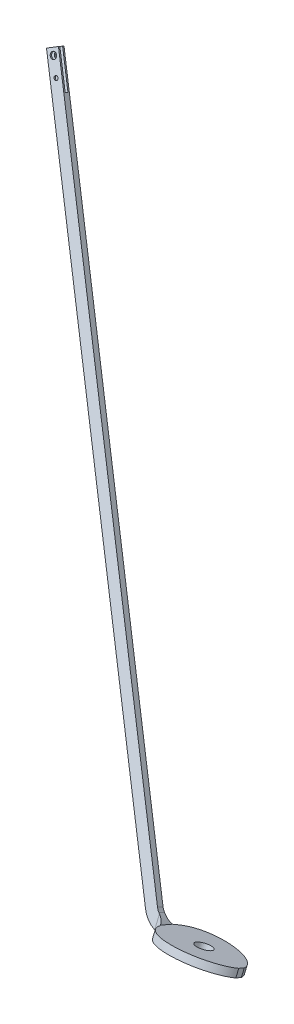
ISO-10303-21;
HEADER;
FILE_DESCRIPTION(('STEP AP214'),'2;1');
FILE_NAME('part.step','',(''),(''),'','','');
FILE_SCHEMA(('AUTOMOTIVE_DESIGN { 1 0 10303 214 1 1 1 1 }'));
ENDSEC;
DATA;
#1=APPLICATION_CONTEXT('core data for automotive mechanical design processes');
#2=APPLICATION_PROTOCOL_DEFINITION('international standard','automotive_design',2000,#1);
#3=PRODUCT_CONTEXT('',#1,'mechanical');
#4=PRODUCT('Part','Part','',(#3));
#5=PRODUCT_RELATED_PRODUCT_CATEGORY('part','',(#4));
#6=PRODUCT_DEFINITION_FORMATION('','',#4);
#7=PRODUCT_DEFINITION_CONTEXT('part definition',#1,'design');
#8=PRODUCT_DEFINITION('design','',#6,#7);
#9=PRODUCT_DEFINITION_SHAPE('','',#8);
#10=(LENGTH_UNIT() NAMED_UNIT(*) SI_UNIT(.MILLI.,.METRE.));
#11=(NAMED_UNIT(*) PLANE_ANGLE_UNIT() SI_UNIT($,.RADIAN.));
#12=(NAMED_UNIT(*) SI_UNIT($,.STERADIAN.) SOLID_ANGLE_UNIT());
#13=UNCERTAINTY_MEASURE_WITH_UNIT(LENGTH_MEASURE(1.E-05),#10,'distance_accuracy_value','');
#14=(GEOMETRIC_REPRESENTATION_CONTEXT(3) GLOBAL_UNCERTAINTY_ASSIGNED_CONTEXT((#13)) GLOBAL_UNIT_ASSIGNED_CONTEXT((#10,
#11,#12)) REPRESENTATION_CONTEXT('',''));
#15=CARTESIAN_POINT('',(0.,0.,0.));
#16=DIRECTION('',(0.,0.,1.));
#17=DIRECTION('',(1.,0.,0.));
#18=AXIS2_PLACEMENT_3D('',#15,#16,#17);
#19=CARTESIAN_POINT('',(73.8354743095712,-172.673766816012,339.410142549089));
#20=DIRECTION('',(0.49991000846134,-0.78962418854451,0.355785924827847));
#21=DIRECTION('',(0.84490869303847,0.534910553670447,0.));
#22=AXIS2_PLACEMENT_3D('',#19,#20,#21);
#23=PLANE('',#22);
#24=DIRECTION('',(-0.00948596016084249,0.405784850084445,0.913919401261277));
#25=VECTOR('',#24,1.);
#26=CARTESIAN_POINT('',(60.8450932528045,-179.577553216905,342.340626012758));
#27=LINE('',#26,#25);
#28=CARTESIAN_POINT('',(60.8830439239265,-181.200984807456,338.684290329165));
#29=VERTEX_POINT('',#28);
#30=CARTESIAN_POINT('',(60.8450932528045,-179.577553216905,342.340626012758));
#31=VERTEX_POINT('',#30);
#32=EDGE_CURVE('E269',#29,#31,#27,.T.);
#33=ORIENTED_EDGE('',*,*,#32,.T.);
#34=DIRECTION('',(-0.866025403784444,-0.460252426726214,0.195365564244626));
#35=VECTOR('',#34,1.);
#36=CARTESIAN_POINT('',(73.8354743095712,-172.673766816012,339.410142549089));
#37=LINE('',#36,#35);
#38=CARTESIAN_POINT('',(73.8354743095712,-172.673766816012,339.410142549089));
#39=VERTEX_POINT('',#38);
#40=EDGE_CURVE('E315',#39,#31,#37,.T.);
#41=ORIENTED_EDGE('',*,*,#40,.F.);
#42=DIRECTION('',(-0.00948596016084249,0.405784850084445,0.913919401261277));
#43=VECTOR('',#42,1.);
#44=CARTESIAN_POINT('',(73.8354743095712,-172.673766816012,339.410142549089));
#45=LINE('',#44,#43);
#46=CARTESIAN_POINT('',(73.8734249806931,-174.297198406563,335.753806865496));
#47=VERTEX_POINT('',#46);
#48=EDGE_CURVE('E270',#47,#39,#45,.T.);
#49=ORIENTED_EDGE('',*,*,#48,.F.);
#50=DIRECTION('',(-0.866025403784444,-0.460252426726214,0.195365564244626));
#51=VECTOR('',#50,1.);
#52=CARTESIAN_POINT('',(73.8734249806931,-174.297198406563,335.753806865496));
#53=LINE('',#52,#51);
#54=EDGE_CURVE('E287',#47,#29,#53,.T.);
#55=ORIENTED_EDGE('',*,*,#54,.T.);
#56=EDGE_LOOP('',(#33,#41,#49,#55));
#57=FACE_BOUND('',#56,.T.);
#58=ADVANCED_FACE('F42',(#57),#23,.F.);
#59=CARTESIAN_POINT('',(73.8354743095712,-172.673766816012,339.410142549089));
#60=DIRECTION('',(0.,0.390731128489272,0.920504853452441));
#61=DIRECTION('',(0.,-0.920504853452441,0.390731128489272));
#62=AXIS2_PLACEMENT_3D('',#59,#60,#61);
#63=PLANE('',#62);
#64=CARTESIAN_POINT('',(49.393037494552,-147.511267342591,328.729295209734));
#65=DIRECTION('',(0.,0.390731128489272,0.920504853452441));
#66=DIRECTION('',(0.,-0.920504853452441,0.390731128489272));
#67=AXIS2_PLACEMENT_3D('',#64,#65,#66);
#68=CIRCLE('',#67,4.00000000000001);
#69=CARTESIAN_POINT('',(49.393037494552,-151.1932867564,330.292219723691));
#70=VERTEX_POINT('',#69);
#71=EDGE_CURVE('E200',#70,#70,#68,.T.);
#72=ORIENTED_EDGE('',*,*,#71,.T.);
#73=EDGE_LOOP('',(#72));
#74=FACE_BOUND('',#73,.T.);
#75=CARTESIAN_POINT('',(60.1227202562195,-164.618256955643,335.990781481634));
#76=DIRECTION('',(0.,0.390731128489272,0.920504853452441));
#77=DIRECTION('',(0.,-0.920504853452441,0.390731128489272));
#78=AXIS2_PLACEMENT_3D('',#75,#76,#77);
#79=CIRCLE('',#78,2.49999999999999);
#80=CARTESIAN_POINT('',(60.1227202562195,-166.919519089275,336.967609302857));
#81=VERTEX_POINT('',#80);
#82=EDGE_CURVE('E396',#81,#81,#79,.T.);
#83=ORIENTED_EDGE('',*,*,#82,.T.);
#84=EDGE_LOOP('',(#83));
#85=FACE_BOUND('',#84,.T.);
#86=DIRECTION('',(-0.49999999999999,0.79718058739669,-0.338383083321077));
#87=VECTOR('',#86,1.);
#88=CARTESIAN_POINT('',(60.8450932528045,-179.577553216905,342.340626012758));
#89=LINE('',#88,#87);
#90=CARTESIAN_POINT('',(39.0377690065583,-144.808802112559,327.582166777903));
#91=VERTEX_POINT('',#90);
#92=EDGE_CURVE('E290',#31,#91,#89,.T.);
#93=ORIENTED_EDGE('',*,*,#92,.T.);
#94=DIRECTION('',(-0.866025403784444,-0.460252426726214,0.195365564244626));
#95=VECTOR('',#94,1.);
#96=CARTESIAN_POINT('',(52.028150063325,-137.905015711666,324.651683314234));
#97=LINE('',#96,#95);
#98=CARTESIAN_POINT('',(52.028150063325,-137.905015711666,324.651683314234));
#99=VERTEX_POINT('',#98);
#100=EDGE_CURVE('E312',#99,#91,#97,.T.);
#101=ORIENTED_EDGE('',*,*,#100,.F.);
#102=DIRECTION('',(-0.49999999999999,0.79718058739669,-0.338383083321077));
#103=VECTOR('',#102,1.);
#104=CARTESIAN_POINT('',(73.8354743095712,-172.673766816012,339.410142549089));
#105=LINE('',#104,#103);
#106=EDGE_CURVE('E273',#39,#99,#105,.T.);
#107=ORIENTED_EDGE('',*,*,#106,.F.);
#108=ORIENTED_EDGE('',*,*,#40,.T.);
#109=EDGE_LOOP('',(#93,#101,#107,#108));
#110=FACE_BOUND('',#109,.T.);
#111=ADVANCED_FACE('F469',(#74,#85,#110),#63,.F.);
#112=CARTESIAN_POINT('',(52.028150063325,-137.905015711666,324.651683314234));
#113=DIRECTION('',(0.49999999999999,-0.797180587396692,0.338383083321072));
#114=DIRECTION('',(0.847155616637362,0.53134486089523,0.));
#115=AXIS2_PLACEMENT_3D('',#112,#113,#114);
#116=PLANE('',#115);
#117=DIRECTION('',(0.,0.390731128489267,0.920504853452443));
#118=VECTOR('',#117,1.);
#119=CARTESIAN_POINT('',(39.0377690065583,-144.808802112559,327.582166777903));
#120=LINE('',#119,#118);
#121=CARTESIAN_POINT('',(39.0377690065583,-144.02733985558,329.423176484808));
#122=VERTEX_POINT('',#121);
#123=EDGE_CURVE('E292',#91,#122,#120,.T.);
#124=ORIENTED_EDGE('',*,*,#123,.T.);
#125=DIRECTION('',(-0.866025403784444,-0.460252426726214,0.195365564244626));
#126=VECTOR('',#125,1.);
#127=CARTESIAN_POINT('',(52.028150063325,-137.123553454687,326.492693021139));
#128=LINE('',#127,#126);
#129=CARTESIAN_POINT('',(52.028150063325,-137.123553454687,326.492693021139));
#130=VERTEX_POINT('',#129);
#131=EDGE_CURVE('E309',#130,#122,#128,.T.);
#132=ORIENTED_EDGE('',*,*,#131,.F.);
#133=DIRECTION('',(0.,0.390731128489267,0.920504853452443));
#134=VECTOR('',#133,1.);
#135=CARTESIAN_POINT('',(52.028150063325,-137.905015711666,324.651683314234));
#136=LINE('',#135,#134);
#137=EDGE_CURVE('E276',#99,#130,#136,.T.);
#138=ORIENTED_EDGE('',*,*,#137,.F.);
#139=ORIENTED_EDGE('',*,*,#100,.T.);
#140=EDGE_LOOP('',(#124,#132,#138,#139));
#141=FACE_BOUND('',#140,.T.);
#142=ADVANCED_FACE('F475',(#141),#116,.F.);
#143=CARTESIAN_POINT('',(52.028150063325,-137.123553454687,326.492693021139));
#144=DIRECTION('',(0.,-0.39073112848927,-0.920504853452442));
#145=DIRECTION('',(0.,0.920504853452442,-0.39073112848927));
#146=AXIS2_PLACEMENT_3D('',#143,#144,#145);
#147=PLANE('',#146);
#148=CARTESIAN_POINT('',(49.393037494552,-146.729805085612,330.570304916639));
#149=DIRECTION('',(0.,-0.39073112848927,-0.920504853452442));
#150=DIRECTION('',(0.,0.920504853452442,-0.39073112848927));
#151=AXIS2_PLACEMENT_3D('',#148,#149,#150);
#152=CIRCLE('',#151,4.00000000000001);
#153=CARTESIAN_POINT('',(49.393037494552,-143.047785671802,329.007380402682));
#154=VERTEX_POINT('',#153);
#155=EDGE_CURVE('E404',#154,#154,#152,.T.);
#156=ORIENTED_EDGE('',*,*,#155,.T.);
#157=EDGE_LOOP('',(#156));
#158=FACE_BOUND('',#157,.T.);
#159=CARTESIAN_POINT('',(60.1227202562195,-163.836794698665,337.831791188539));
#160=DIRECTION('',(0.,-0.39073112848927,-0.920504853452442));
#161=DIRECTION('',(0.,0.920504853452442,-0.39073112848927));
#162=AXIS2_PLACEMENT_3D('',#159,#160,#161);
#163=CIRCLE('',#162,2.49999999999999);
#164=CARTESIAN_POINT('',(60.1227202562195,-161.535532565034,336.854963367316));
#165=VERTEX_POINT('',#164);
#166=EDGE_CURVE('E391',#165,#165,#163,.T.);
#167=ORIENTED_EDGE('',*,*,#166,.T.);
#168=EDGE_LOOP('',(#167));
#169=FACE_BOUND('',#168,.T.);
#170=DIRECTION('',(0.,0.920504853452442,-0.39073112848927));
#171=VECTOR('',#170,1.);
#172=CARTESIAN_POINT('',(464.242672066385,-137.123553454669,326.492693021134));
#173=LINE('',#172,#171);
#174=CARTESIAN_POINT('',(464.242672066418,-806.651639318932,610.690504215532));
#175=VERTEX_POINT('',#174);
#176=CARTESIAN_POINT('',(464.242672066418,-791.64769856536,604.32170922174));
#177=VERTEX_POINT('',#176);
#178=EDGE_CURVE('E323',#175,#177,#173,.T.);
#179=ORIENTED_EDGE('',*,*,#178,.T.);
#180=CARTESIAN_POINT('',(368.692420540358,-898.085087793585,649.50170045222));
#181=DIRECTION('',(0.,-0.39073112848927,-0.920504853452442));
#182=DIRECTION('',(0.,0.920504853452442,-0.39073112848927));
#183=AXIS2_PLACEMENT_3D('',#180,#181,#182);
#184=CIRCLE('',#183,150.);
#185=CARTESIAN_POINT('',(463.207207415303,-790.867192931226,603.99040423614));
#186=VERTEX_POINT('',#185);
#187=EDGE_CURVE('E377',#177,#186,#184,.F.);
#188=ORIENTED_EDGE('',*,*,#187,.T.);
#189=CARTESIAN_POINT('',(472.658686102798,-780.14540344499,599.439274614532));
#190=DIRECTION('',(0.,-0.39073112848927,-0.920504853452442));
#191=DIRECTION('',(0.,0.920504853452442,-0.39073112848927));
#192=AXIS2_PLACEMENT_3D('',#189,#190,#191);
#193=CIRCLE('',#192,15.);
#194=CARTESIAN_POINT('',(459.668305046031,-787.049189845883,602.369758078202));
#195=VERTEX_POINT('',#194);
#196=EDGE_CURVE('E215',#186,#195,#193,.T.);
#197=ORIENTED_EDGE('',*,*,#196,.T.);
#198=DIRECTION('',(0.499999999999991,-0.79718058739669,0.338383083321074));
#199=VECTOR('',#198,1.);
#200=CARTESIAN_POINT('',(52.028150063325,-137.123553454687,326.492693021139));
#201=LINE('',#200,#199);
#202=EDGE_CURVE('E278',#130,#195,#201,.T.);
#203=ORIENTED_EDGE('',*,*,#202,.F.);
#204=ORIENTED_EDGE('',*,*,#131,.T.);
#205=DIRECTION('',(0.499999999999991,-0.79718058739669,0.338383083321074));
#206=VECTOR('',#205,1.);
#207=CARTESIAN_POINT('',(39.0377690065583,-144.02733985558,329.423176484808));
#208=LINE('',#207,#206);
#209=CARTESIAN_POINT('',(446.677923989264,-793.952976246776,605.300241541871));
#210=VERTEX_POINT('',#209);
#211=EDGE_CURVE('E294',#122,#210,#208,.T.);
#212=ORIENTED_EDGE('',*,*,#211,.T.);
#213=CARTESIAN_POINT('',(472.658686102798,-780.14540344499,599.439274614532));
#214=DIRECTION('',(0.,0.39073112848927,0.920504853452442));
#215=DIRECTION('',(0.,0.920504853452442,-0.39073112848927));
#216=AXIS2_PLACEMENT_3D('',#213,#214,#215);
#217=CIRCLE('',#216,30.);
#218=EDGE_CURVE('E216',#210,#175,#217,.T.);
#219=ORIENTED_EDGE('',*,*,#218,.T.);
#220=EDGE_LOOP('',(#179,#188,#197,#203,#204,#212,#219));
#221=FACE_BOUND('',#220,.T.);
#222=ADVANCED_FACE('F481',(#158,#169,#221),#147,.F.);
#223=CARTESIAN_POINT('',(52.028150063325,-140.249402482601,319.128654193519));
#224=DIRECTION('',(0.,0.39073112848927,0.920504853452442));
#225=DIRECTION('',(0.,-0.920504853452442,0.39073112848927));
#226=AXIS2_PLACEMENT_3D('',#223,#224,#225);
#227=PLANE('',#226);
#228=CARTESIAN_POINT('',(49.393037494552,-149.855654113526,323.206266089019));
#229=DIRECTION('',(0.,0.39073112848927,0.920504853452442));
#230=DIRECTION('',(0.,-0.920504853452442,0.39073112848927));
#231=AXIS2_PLACEMENT_3D('',#228,#229,#230);
#232=CIRCLE('',#231,4.00000000000001);
#233=CARTESIAN_POINT('',(49.393037494552,-153.537673527336,324.769190602977));
#234=VERTEX_POINT('',#233);
#235=EDGE_CURVE('E401',#234,#234,#232,.T.);
#236=ORIENTED_EDGE('',*,*,#235,.T.);
#237=EDGE_LOOP('',(#236));
#238=FACE_BOUND('',#237,.T.);
#239=CARTESIAN_POINT('',(60.1227202562195,-166.962643726579,330.46775236092));
#240=DIRECTION('',(0.,0.39073112848927,0.920504853452442));
#241=DIRECTION('',(0.,-0.920504853452442,0.39073112848927));
#242=AXIS2_PLACEMENT_3D('',#239,#240,#241);
#243=CIRCLE('',#242,2.49999999999999);
#244=CARTESIAN_POINT('',(60.1227202562195,-169.26390586021,331.444580182143));
#245=VERTEX_POINT('',#244);
#246=EDGE_CURVE('E387',#245,#245,#243,.T.);
#247=ORIENTED_EDGE('',*,*,#246,.T.);
#248=EDGE_LOOP('',(#247));
#249=FACE_BOUND('',#248,.T.);
#250=CARTESIAN_POINT('',(472.658686102798,-783.271252472904,592.075235786913));
#251=DIRECTION('',(0.,0.39073112848927,0.920504853452442));
#252=DIRECTION('',(0.,-0.920504853452442,0.39073112848927));
#253=AXIS2_PLACEMENT_3D('',#250,#251,#252);
#254=CIRCLE('',#253,15.);
#255=CARTESIAN_POINT('',(459.668305046031,-790.175038873797,595.005719250582));
#256=VERTEX_POINT('',#255);
#257=CARTESIAN_POINT('',(463.207207415303,-793.99304195914,596.626365408521));
#258=VERTEX_POINT('',#257);
#259=EDGE_CURVE('E253',#256,#258,#254,.T.);
#260=ORIENTED_EDGE('',*,*,#259,.T.);
#261=CARTESIAN_POINT('',(368.692420540358,-901.210936821499,642.1376616246));
#262=DIRECTION('',(0.,0.39073112848927,0.920504853452442));
#263=DIRECTION('',(0.,-0.920504853452442,0.39073112848927));
#264=AXIS2_PLACEMENT_3D('',#261,#262,#263);
#265=CIRCLE('',#264,150.);
#266=CARTESIAN_POINT('',(464.242672066418,-794.773547593274,596.95767039412));
#267=VERTEX_POINT('',#266);
#268=EDGE_CURVE('E53',#258,#267,#265,.F.);
#269=ORIENTED_EDGE('',*,*,#268,.T.);
#270=DIRECTION('',(0.,0.920504853452442,-0.39073112848927));
#271=VECTOR('',#270,1.);
#272=CARTESIAN_POINT('',(464.242672066385,-140.249402482583,319.128654193514));
#273=LINE('',#272,#271);
#274=CARTESIAN_POINT('',(464.242672066418,-809.777488346846,603.326465387913));
#275=VERTEX_POINT('',#274);
#276=EDGE_CURVE('E321',#267,#275,#273,.F.);
#277=ORIENTED_EDGE('',*,*,#276,.T.);
#278=CARTESIAN_POINT('',(472.658686102798,-783.271252472904,592.075235786913));
#279=DIRECTION('',(0.,0.39073112848927,0.920504853452442));
#280=DIRECTION('',(0.,-0.920504853452442,0.39073112848927));
#281=AXIS2_PLACEMENT_3D('',#278,#279,#280);
#282=CIRCLE('',#281,30.);
#283=CARTESIAN_POINT('',(446.677923989264,-797.07882527469,597.936202714252));
#284=VERTEX_POINT('',#283);
#285=EDGE_CURVE('E228',#275,#284,#282,.F.);
#286=ORIENTED_EDGE('',*,*,#285,.T.);
#287=DIRECTION('',(-0.499999999999991,0.79718058739669,-0.338383083321074));
#288=VECTOR('',#287,1.);
#289=CARTESIAN_POINT('',(39.0377690065583,-147.153188883495,322.059137657189));
#290=LINE('',#289,#288);
#291=CARTESIAN_POINT('',(39.0377690065583,-147.153188883495,322.059137657189));
#292=VERTEX_POINT('',#291);
#293=EDGE_CURVE('E296',#284,#292,#290,.T.);
#294=ORIENTED_EDGE('',*,*,#293,.T.);
#295=DIRECTION('',(-0.866025403784444,-0.460252426726214,0.195365564244626));
#296=VECTOR('',#295,1.);
#297=CARTESIAN_POINT('',(52.028150063325,-140.249402482601,319.128654193519));
#298=LINE('',#297,#296);
#299=CARTESIAN_POINT('',(52.028150063325,-140.249402482601,319.128654193519));
#300=VERTEX_POINT('',#299);
#301=EDGE_CURVE('E306',#300,#292,#298,.T.);
#302=ORIENTED_EDGE('',*,*,#301,.F.);
#303=DIRECTION('',(-0.499999999999991,0.79718058739669,-0.338383083321074));
#304=VECTOR('',#303,1.);
#305=CARTESIAN_POINT('',(52.028150063325,-140.249402482601,319.128654193519));
#306=LINE('',#305,#304);
#307=EDGE_CURVE('E281',#256,#300,#306,.T.);
#308=ORIENTED_EDGE('',*,*,#307,.F.);
#309=EDGE_LOOP('',(#260,#269,#277,#286,#294,#302,#308));
#310=FACE_BOUND('',#309,.T.);
#311=ADVANCED_FACE('F485',(#238,#249,#310),#227,.F.);
#312=CARTESIAN_POINT('',(52.028150063325,-139.467940225623,320.969663900424));
#313=DIRECTION('',(0.49999999999999,-0.797180587396683,0.338383083321093));
#314=DIRECTION('',(0.847155616637359,0.531344860895234,0.));
#315=AXIS2_PLACEMENT_3D('',#312,#313,#314);
#316=PLANE('',#315);
#317=DIRECTION('',(0.,0.390731128489291,0.920504853452433));
#318=VECTOR('',#317,1.);
#319=CARTESIAN_POINT('',(39.0377690065583,-146.371726626516,323.900147364094));
#320=LINE('',#319,#318);
#321=CARTESIAN_POINT('',(39.0377690065583,-146.371726626516,323.900147364094));
#322=VERTEX_POINT('',#321);
#323=EDGE_CURVE('E298',#292,#322,#320,.T.);
#324=ORIENTED_EDGE('',*,*,#323,.T.);
#325=DIRECTION('',(-0.866025403784444,-0.460252426726214,0.195365564244626));
#326=VECTOR('',#325,1.);
#327=CARTESIAN_POINT('',(52.028150063325,-139.467940225623,320.969663900424));
#328=LINE('',#327,#326);
#329=CARTESIAN_POINT('',(52.028150063325,-139.467940225623,320.969663900424));
#330=VERTEX_POINT('',#329);
#331=EDGE_CURVE('E303',#330,#322,#328,.T.);
#332=ORIENTED_EDGE('',*,*,#331,.F.);
#333=DIRECTION('',(0.,0.390731128489291,0.920504853452433));
#334=VECTOR('',#333,1.);
#335=CARTESIAN_POINT('',(52.028150063325,-139.467940225623,320.969663900424));
#336=LINE('',#335,#334);
#337=EDGE_CURVE('E283',#300,#330,#336,.T.);
#338=ORIENTED_EDGE('',*,*,#337,.F.);
#339=ORIENTED_EDGE('',*,*,#301,.T.);
#340=EDGE_LOOP('',(#324,#332,#338,#339));
#341=FACE_BOUND('',#340,.T.);
#342=ADVANCED_FACE('F495',(#341),#316,.F.);
#343=CARTESIAN_POINT('',(52.028150063325,-139.467940225623,320.969663900424));
#344=DIRECTION('',(0.,-0.390731128489271,-0.920504853452442));
#345=DIRECTION('',(0.,0.920504853452442,-0.390731128489271));
#346=AXIS2_PLACEMENT_3D('',#343,#344,#345);
#347=PLANE('',#346);
#348=CARTESIAN_POINT('',(49.393037494552,-149.074191856548,325.047275795924));
#349=DIRECTION('',(0.,-0.390731128489271,-0.920504853452442));
#350=DIRECTION('',(0.,0.920504853452442,-0.390731128489271));
#351=AXIS2_PLACEMENT_3D('',#348,#349,#350);
#352=CIRCLE('',#351,4.00000000000001);
#353=CARTESIAN_POINT('',(49.393037494552,-145.392172442738,323.484351281967));
#354=VERTEX_POINT('',#353);
#355=EDGE_CURVE('E47',#354,#354,#352,.T.);
#356=ORIENTED_EDGE('',*,*,#355,.T.);
#357=EDGE_LOOP('',(#356));
#358=FACE_BOUND('',#357,.T.);
#359=CARTESIAN_POINT('',(60.1227202562195,-166.181181469601,332.308762067824));
#360=DIRECTION('',(0.,-0.390731128489271,-0.920504853452442));
#361=DIRECTION('',(0.,0.920504853452442,-0.390731128489271));
#362=AXIS2_PLACEMENT_3D('',#359,#360,#361);
#363=CIRCLE('',#362,2.49999999999999);
#364=CARTESIAN_POINT('',(60.1227202562195,-163.879919335969,331.331934246601));
#365=VERTEX_POINT('',#364);
#366=EDGE_CURVE('E385',#365,#365,#363,.T.);
#367=ORIENTED_EDGE('',*,*,#366,.T.);
#368=EDGE_LOOP('',(#367));
#369=FACE_BOUND('',#368,.T.);
#370=DIRECTION('',(0.49999999999999,-0.797180587396691,0.338383083321076));
#371=VECTOR('',#370,1.);
#372=CARTESIAN_POINT('',(39.0377690065583,-146.371726626516,323.900147364094));
#373=LINE('',#372,#371);
#374=EDGE_CURVE('E274',#322,#29,#373,.T.);
#375=ORIENTED_EDGE('',*,*,#374,.T.);
#376=ORIENTED_EDGE('',*,*,#54,.F.);
#377=DIRECTION('',(0.49999999999999,-0.797180587396691,0.338383083321076));
#378=VECTOR('',#377,1.);
#379=CARTESIAN_POINT('',(52.028150063325,-139.467940225623,320.969663900424));
#380=LINE('',#379,#378);
#381=EDGE_CURVE('E285',#330,#47,#380,.T.);
#382=ORIENTED_EDGE('',*,*,#381,.F.);
#383=ORIENTED_EDGE('',*,*,#331,.T.);
#384=EDGE_LOOP('',(#375,#376,#382,#383));
#385=FACE_BOUND('',#384,.T.);
#386=ADVANCED_FACE('F499',(#358,#369,#385),#347,.F.);
#387=CARTESIAN_POINT('',(-70.8748069701137,-37.6666801680404,15.9885571415544));
#388=DIRECTION('',(-0.866025403784445,-0.460252426726213,0.195365564244627));
#389=DIRECTION('',(0.469295520911046,-0.88304117347541,0.));
#390=AXIS2_PLACEMENT_3D('',#387,#388,#389);
#391=PLANE('',#390);
#392=ORIENTED_EDGE('',*,*,#48,.T.);
#393=ORIENTED_EDGE('',*,*,#106,.T.);
#394=ORIENTED_EDGE('',*,*,#137,.T.);
#395=ORIENTED_EDGE('',*,*,#202,.T.);
#396=DIRECTION('',(0.,0.39073112848927,0.920504853452442));
#397=VECTOR('',#396,1.);
#398=CARTESIAN_POINT('',(459.668305046032,-845.4224437913,464.85098967006));
#399=LINE('',#398,#397);
#400=EDGE_CURVE('E225',#256,#195,#399,.T.);
#401=ORIENTED_EDGE('',*,*,#400,.F.);
#402=ORIENTED_EDGE('',*,*,#307,.T.);
#403=ORIENTED_EDGE('',*,*,#337,.T.);
#404=ORIENTED_EDGE('',*,*,#381,.T.);
#405=EDGE_LOOP('',(#392,#393,#394,#395,#401,#402,#403,#404));
#406=FACE_BOUND('',#405,.T.);
#407=ADVANCED_FACE('F503',(#406),#391,.F.);
#408=CARTESIAN_POINT('',(-83.8651880268803,-44.5704665689336,18.9190406052238));
#409=DIRECTION('',(-0.866025403784445,-0.460252426726213,0.195365564244627));
#410=DIRECTION('',(0.469295520911046,-0.88304117347541,0.));
#411=AXIS2_PLACEMENT_3D('',#408,#409,#410);
#412=PLANE('',#411);
#413=ORIENTED_EDGE('',*,*,#32,.F.);
#414=ORIENTED_EDGE('',*,*,#374,.F.);
#415=ORIENTED_EDGE('',*,*,#323,.F.);
#416=ORIENTED_EDGE('',*,*,#293,.F.);
#417=DIRECTION('',(0.,0.39073112848927,0.920504853452442));
#418=VECTOR('',#417,1.);
#419=CARTESIAN_POINT('',(446.677923989265,-852.326230192193,467.781473133729));
#420=LINE('',#419,#418);
#421=EDGE_CURVE('E218',#284,#210,#420,.T.);
#422=ORIENTED_EDGE('',*,*,#421,.T.);
#423=ORIENTED_EDGE('',*,*,#211,.F.);
#424=ORIENTED_EDGE('',*,*,#123,.F.);
#425=ORIENTED_EDGE('',*,*,#92,.F.);
#426=EDGE_LOOP('',(#413,#414,#415,#416,#422,#423,#424,#425));
#427=FACE_BOUND('',#426,.T.);
#428=ADVANCED_FACE('F460',(#427),#412,.T.);
#429=CARTESIAN_POINT('',(472.658686102799,-838.518657390406,461.92050620639));
#430=DIRECTION('',(0.,0.39073112848927,0.920504853452442));
#431=DIRECTION('',(0.,-0.920504853452442,0.39073112848927));
#432=AXIS2_PLACEMENT_3D('',#429,#430,#431);
#433=CYLINDRICAL_SURFACE('',#432,15.);
#434=ORIENTED_EDGE('',*,*,#196,.F.);
#435=DIRECTION('',(0.,0.39073112848927,0.920504853452442));
#436=VECTOR('',#435,1.);
#437=CARTESIAN_POINT('',(463.207207415304,-849.240446876642,466.471635827998));
#438=LINE('',#437,#436);
#439=EDGE_CURVE('E68',#186,#258,#438,.F.);
#440=ORIENTED_EDGE('',*,*,#439,.T.);
#441=ORIENTED_EDGE('',*,*,#259,.F.);
#442=ORIENTED_EDGE('',*,*,#400,.T.);
#443=EDGE_LOOP('',(#434,#440,#441,#442));
#444=FACE_BOUND('',#443,.T.);
#445=ADVANCED_FACE('F458',(#444),#433,.F.);
#446=CARTESIAN_POINT('',(572.658686102807,-866.133802993975,473.642440061067));
#447=DIRECTION('',(1.,0.,0.));
#448=DIRECTION('',(0.,0.,-1.));
#449=AXIS2_PLACEMENT_3D('',#446,#447,#448);
#450=PLANE('',#449);
#451=DIRECTION('',(0.,-0.390731128489271,-0.920504853452442));
#452=VECTOR('',#451,1.);
#453=CARTESIAN_POINT('',(572.658686102806,-798.555500514034,607.253897184317));
#454=LINE('',#453,#452);
#455=CARTESIAN_POINT('',(572.658686102806,-798.555500514034,607.253897184317));
#456=VERTEX_POINT('',#455);
#457=CARTESIAN_POINT('',(572.658686102806,-801.681349541948,599.889858356697));
#458=VERTEX_POINT('',#457);
#459=EDGE_CURVE('E192',#456,#458,#454,.T.);
#460=ORIENTED_EDGE('',*,*,#459,.F.);
#461=DIRECTION('',(0.,0.920504853452442,-0.390731128489269));
#462=VECTOR('',#461,1.);
#463=CARTESIAN_POINT('',(572.658686102806,-807.760549048559,611.161208469209));
#464=LINE('',#463,#462);
#465=CARTESIAN_POINT('',(572.658686102806,-807.760549048559,611.161208469209));
#466=VERTEX_POINT('',#465);
#467=EDGE_CURVE('E207',#466,#456,#464,.T.);
#468=ORIENTED_EDGE('',*,*,#467,.F.);
#469=DIRECTION('',(0.,0.39073112848927,0.920504853452442));
#470=VECTOR('',#469,1.);
#471=CARTESIAN_POINT('',(572.658686102807,-866.133802993975,473.642440061067));
#472=LINE('',#471,#470);
#473=CARTESIAN_POINT('',(572.658686102806,-810.886398076473,603.79716964159));
#474=VERTEX_POINT('',#473);
#475=EDGE_CURVE('E229',#474,#466,#472,.T.);
#476=ORIENTED_EDGE('',*,*,#475,.F.);
#477=DIRECTION('',(0.,-0.920504853452442,0.39073112848927));
#478=VECTOR('',#477,1.);
#479=CARTESIAN_POINT('',(572.658686102806,-810.886398076473,603.79716964159));
#480=LINE('',#479,#478);
#481=EDGE_CURVE('E208',#458,#474,#480,.T.);
#482=ORIENTED_EDGE('',*,*,#481,.F.);
#483=EDGE_LOOP('',(#460,#468,#476,#482));
#484=FACE_BOUND('',#483,.T.);
#485=ADVANCED_FACE('F205',(#484),#450,.T.);
#486=CARTESIAN_POINT('',(472.658686102799,-866.133802993979,473.642440061068));
#487=DIRECTION('',(0.,-0.920504853452442,0.39073112848927));
#488=DIRECTION('',(0.,-0.39073112848927,-0.920504853452442));
#489=AXIS2_PLACEMENT_3D('',#486,#487,#488);
#490=PLANE('',#489);
#491=CARTESIAN_POINT('',(522.658686102802,-809.323473562518,607.4791890554));
#492=DIRECTION('',(0.,-0.920504853452442,0.39073112848927));
#493=DIRECTION('',(0.,-0.39073112848927,-0.920504853452442));
#494=AXIS2_PLACEMENT_3D('',#491,#492,#493);
#495=CIRCLE('',#494,10.);
#496=CARTESIAN_POINT('',(522.658686102802,-813.230784847411,598.274140520876));
#497=VERTEX_POINT('',#496);
#498=EDGE_CURVE('E363',#497,#497,#495,.T.);
#499=ORIENTED_EDGE('',*,*,#498,.F.);
#500=EDGE_LOOP('',(#499));
#501=FACE_BOUND('',#500,.T.);
#502=DIRECTION('',(0.,0.39073112848927,0.920504853452442));
#503=VECTOR('',#502,1.);
#504=CARTESIAN_POINT('',(472.658686102799,-866.133802993979,473.642440061068));
#505=LINE('',#504,#503);
#506=CARTESIAN_POINT('',(472.658686102798,-812.683373909832,599.563759873253));
#507=VERTEX_POINT('',#506);
#508=CARTESIAN_POINT('',(472.658686102798,-805.963573215208,615.394618237548));
#509=VERTEX_POINT('',#508);
#510=EDGE_CURVE('E231',#507,#509,#505,.T.);
#511=ORIENTED_EDGE('',*,*,#510,.F.);
#512=CARTESIAN_POINT('',(464.242672066418,-814.79370936137,594.592121107066));
#513=DIRECTION('',(0.,-0.920504853452442,0.39073112848927));
#514=DIRECTION('',(0.,-0.39073112848927,-0.920504853452442));
#515=AXIS2_PLACEMENT_3D('',#512,#513,#514);
#516=CIRCLE('',#515,10.);
#517=CARTESIAN_POINT('',(473.913286852462,-813.79913094925,596.935201012255));
#518=VERTEX_POINT('',#517);
#519=EDGE_CURVE('E337',#507,#518,#516,.F.);
#520=ORIENTED_EDGE('',*,*,#519,.T.);
#521=CARTESIAN_POINT('',(572.658686102806,-810.886398076473,603.79716964159));
#522=CARTESIAN_POINT('',(559.130606949825,-826.198653377937,567.723756763539));
#523=CARTESIAN_POINT('',(476.930397752689,-831.068210059177,556.251800135536));
#524=CARTESIAN_POINT('',(472.658686102798,-810.886398076477,603.797169641591));
#525=B_SPLINE_CURVE_WITH_KNOTS('',3,(#521,#522,#523,#524),.UNSPECIFIED.,.F.,.F.,(4,4),(0.,1.),.UNSPECIFIED.);
#526=EDGE_CURVE('E221',#474,#518,#525,.T.);
#527=ORIENTED_EDGE('',*,*,#526,.F.);
#528=ORIENTED_EDGE('',*,*,#475,.T.);
#529=CARTESIAN_POINT('',(472.658686102798,-807.760549048563,611.16120846921));
#530=CARTESIAN_POINT('',(476.930397752689,-787.578737065863,658.706577975265));
#531=CARTESIAN_POINT('',(559.130606949824,-792.448293747096,647.23462134726));
#532=CARTESIAN_POINT('',(572.658686102806,-807.760549048558,611.161208469209));
#533=B_SPLINE_CURVE_WITH_KNOTS('',3,(#529,#530,#531,#532),.UNSPECIFIED.,.F.,.F.,(4,4),(0.,1.),.UNSPECIFIED.);
#534=CARTESIAN_POINT('',(473.913286852462,-804.847816175789,618.023177098547));
#535=VERTEX_POINT('',#534);
#536=EDGE_CURVE('E213',#535,#466,#533,.T.);
#537=ORIENTED_EDGE('',*,*,#536,.F.);
#538=CARTESIAN_POINT('',(464.242672066418,-803.853237763671,620.366257003735));
#539=DIRECTION('',(0.,-0.920504853452442,0.39073112848927));
#540=DIRECTION('',(0.,-0.39073112848927,-0.920504853452442));
#541=AXIS2_PLACEMENT_3D('',#538,#539,#540);
#542=CIRCLE('',#541,10.);
#543=EDGE_CURVE('E362',#535,#509,#542,.F.);
#544=ORIENTED_EDGE('',*,*,#543,.T.);
#545=EDGE_LOOP('',(#511,#520,#527,#528,#537,#544));
#546=FACE_BOUND('',#545,.T.);
#547=ADVANCED_FACE('F348',(#501,#546),#490,.T.);
#548=CARTESIAN_POINT('',(472.658686102799,-838.518657390406,461.92050620639));
#549=DIRECTION('',(0.,0.39073112848927,0.920504853452442));
#550=DIRECTION('',(0.,-0.920504853452442,0.39073112848927));
#551=AXIS2_PLACEMENT_3D('',#548,#549,#550);
#552=CYLINDRICAL_SURFACE('',#551,30.);
#553=ORIENTED_EDGE('',*,*,#285,.F.);
#554=CARTESIAN_POINT('',(464.242672066418,-809.777488346846,603.326465387913));
#555=CARTESIAN_POINT('',(464.507090761484,-809.848646645193,603.356707272462));
#556=CARTESIAN_POINT('',(464.772624213005,-809.920524129679,603.375787743976));
#557=CARTESIAN_POINT('',(465.3040513973,-810.065558891543,603.391251877887));
#558=CARTESIAN_POINT('',(465.569945188594,-810.138716407809,603.38763125764));
#559=CARTESIAN_POINT('',(466.099541329562,-810.285964058909,603.357340776114));
#560=CARTESIAN_POINT('',(466.363247206058,-810.360051796996,603.330721473399));
#561=CARTESIAN_POINT('',(466.886998653535,-810.509237804016,603.254468509452));
#562=CARTESIAN_POINT('',(467.147044561318,-810.584335978705,603.204836980337));
#563=CARTESIAN_POINT('',(467.662000050522,-810.735716521845,603.082664932373));
#564=CARTESIAN_POINT('',(467.916897174468,-810.81200111828,603.010074619349));
#565=CARTESIAN_POINT('',(468.418910539616,-810.96567636121,602.842556889574));
#566=CARTESIAN_POINT('',(468.666026495301,-811.04306704814,602.747628654249));
#567=CARTESIAN_POINT('',(469.150512473009,-811.199116518699,602.536237232369));
#568=CARTESIAN_POINT('',(469.38788065741,-811.277775537575,602.419770007913));
#569=CARTESIAN_POINT('',(469.850928649711,-811.436556907339,602.166386652315));
#570=CARTESIAN_POINT('',(470.076608030637,-811.516679311538,602.029469774885));
#571=CARTESIAN_POINT('',(470.527185068852,-811.683326036321,601.727993853085));
#572=CARTESIAN_POINT('',(470.751282557463,-811.769952602205,601.562294057915));
#573=CARTESIAN_POINT('',(471.182540367295,-811.945457202511,601.211173511737));
#574=CARTESIAN_POINT('',(471.389698593964,-812.034335513589,601.02575032842));
#575=CARTESIAN_POINT('',(471.785799773293,-812.214875376866,600.636647534265));
#576=CARTESIAN_POINT('',(471.974699443008,-812.30654289649,600.432926649548));
#577=CARTESIAN_POINT('',(472.332242833428,-812.492738702423,600.009683448481));
#578=CARTESIAN_POINT('',(472.50088922074,-812.587266610067,599.79016321842));
#579=CARTESIAN_POINT('',(472.658686102798,-812.683373909832,599.563759873253));
#580=B_SPLINE_CURVE_WITH_KNOTS('',3,(#554,#555,#556,#557,#558,#559,#560,#561,#562,#563,#564,
#565,#566,#567,#568,#569,#570,#571,#572,#573,#574,#575,#576,#577,#578,#579),.UNSPECIFIED.,.F.,
.F.,(4,2,2,2,2,2,2,2,2,2,2,2,4),(0.,0.82629257994111,1.65274104774769,2.4773773231857,
3.30193721015237,4.12829785145712,4.95468877950283,5.78123478789828,6.60781096753262,
7.48219481252137,8.35668661275058,9.23320306123304,10.1096039781869),.UNSPECIFIED.);
#581=EDGE_CURVE('E328',#275,#507,#580,.T.);
#582=ORIENTED_EDGE('',*,*,#581,.T.);
#583=ORIENTED_EDGE('',*,*,#510,.T.);
#584=CARTESIAN_POINT('',(472.658686102798,-805.963573215208,615.394618237548));
#585=CARTESIAN_POINT('',(472.509770037335,-806.054259716234,615.180964356748));
#586=CARTESIAN_POINT('',(472.351199390334,-806.14151492514,614.972577106037));
#587=CARTESIAN_POINT('',(472.015962009804,-806.30775440617,614.56735704601));
#588=CARTESIAN_POINT('',(471.83929409425,-806.386738137359,614.370524992746));
#589=CARTESIAN_POINT('',(471.469420269461,-806.534883821916,613.989799479711));
#590=CARTESIAN_POINT('',(471.276243963893,-806.604062788894,613.805883893725));
#591=CARTESIAN_POINT('',(470.87451300179,-806.731405292151,613.45154468522));
#592=CARTESIAN_POINT('',(470.665959108198,-806.789569374413,613.28112039421));
#593=CARTESIAN_POINT('',(470.23464978274,-806.89371018241,612.954307215148));
#594=CARTESIAN_POINT('',(470.011870056798,-806.939665328479,612.797943497966));
#595=CARTESIAN_POINT('',(469.554165902452,-807.018112139741,612.500328509892));
#596=CARTESIAN_POINT('',(469.319241217478,-807.050603520371,612.359077558461));
#597=CARTESIAN_POINT('',(468.839122343987,-807.101153661547,612.092319785507));
#598=CARTESIAN_POINT('',(468.593928188534,-807.119212468557,611.966812913298));
#599=CARTESIAN_POINT('',(468.09525475935,-807.140146310183,611.732038737265));
#600=CARTESIAN_POINT('',(467.841775295977,-807.143020997006,611.622771805474));
#601=CARTESIAN_POINT('',(467.31445038112,-807.132801807375,611.415269975977));
#602=CARTESIAN_POINT('',(467.040252020867,-807.118820001415,611.317973735559));
#603=CARTESIAN_POINT('',(466.48733436254,-807.073110478146,611.142076567553));
#604=CARTESIAN_POINT('',(466.208614314556,-807.041379787396,611.063478775629));
#605=CARTESIAN_POINT('',(465.64833822145,-806.960102077838,610.92486123695));
#606=CARTESIAN_POINT('',(465.366776452322,-806.910505857132,610.864893655918));
#607=CARTESIAN_POINT('',(464.803948256154,-806.793968185093,610.763694944033));
#608=CARTESIAN_POINT('',(464.522681771382,-806.727031244182,610.722458948655));
#609=CARTESIAN_POINT('',(464.242672066418,-806.651639318932,610.690504215532));
#610=B_SPLINE_CURVE_WITH_KNOTS('',3,(#584,#585,#586,#587,#588,#589,#590,#591,#592,#593,#594,
#595,#596,#597,#598,#599,#600,#601,#602,#603,#604,#605,#606,#607,#608,#609),.UNSPECIFIED.,.F.,
.F.,(4,2,2,2,2,2,2,2,2,2,2,2,4),(0.,0.827074606174495,1.65420326733005,2.479878613723,
3.3055130225028,4.132597199772,4.95969885689159,5.78679785122383,6.61391579019176,
7.48657410652534,8.35937866160806,9.23460554291118,10.1096050008468),.UNSPECIFIED.);
#611=EDGE_CURVE('E355',#509,#175,#610,.T.);
#612=ORIENTED_EDGE('',*,*,#611,.T.);
#613=ORIENTED_EDGE('',*,*,#218,.F.);
#614=ORIENTED_EDGE('',*,*,#421,.F.);
#615=EDGE_LOOP('',(#553,#582,#583,#612,#613,#614));
#616=FACE_BOUND('',#615,.T.);
#617=ADVANCED_FACE('F342',(#616),#552,.T.);
#618=CARTESIAN_POINT('',(572.658686102812,-928.336078845421,653.651601299865));
#619=CARTESIAN_POINT('',(559.130606949831,-943.648334146886,617.578188421814));
#620=CARTESIAN_POINT('',(476.930397752694,-948.517890828126,606.106231793812));
#621=CARTESIAN_POINT('',(472.658686102804,-928.336078845426,653.651601299866));
#622=B_SPLINE_CURVE_WITH_KNOTS('',3,(#618,#619,#620,#621),.UNSPECIFIED.,.F.,.F.,(4,4),(0.,1.),.UNSPECIFIED.);
#623=DIRECTION('',(0.,0.920504853452442,-0.39073112848927));
#624=VECTOR('',#623,1.);
#625=SURFACE_OF_LINEAR_EXTRUSION('',#622,#624);
#626=CARTESIAN_POINT('',(572.658686102806,-801.681349541948,599.889858356697));
#627=CARTESIAN_POINT('',(559.825252030608,-816.207345190391,565.668757142368));
#628=CARTESIAN_POINT('',(485.191029648613,-821.33553992023,553.587487455681));
#629=CARTESIAN_POINT('',(473.913286852462,-804.594082414726,593.027889727362));
#630=B_SPLINE_CURVE_WITH_KNOTS('',3,(#626,#627,#628,#629),.UNSPECIFIED.,.F.,.F.,(4,4),(0.,
0.948651610259786),.UNSPECIFIED.);
#631=CARTESIAN_POINT('',(473.913286852462,-804.594082414726,593.027889727362));
#632=VERTEX_POINT('',#631);
#633=EDGE_CURVE('E209',#458,#632,#630,.T.);
#634=ORIENTED_EDGE('',*,*,#633,.F.);
#635=ORIENTED_EDGE('',*,*,#481,.T.);
#636=ORIENTED_EDGE('',*,*,#526,.T.);
#637=DIRECTION('',(0.,0.920504853452442,-0.39073112848927));
#638=VECTOR('',#637,1.);
#639=CARTESIAN_POINT('',(473.913286852462,-813.799130949251,596.935201012254));
#640=LINE('',#639,#638);
#641=EDGE_CURVE('E318',#518,#632,#640,.T.);
#642=ORIENTED_EDGE('',*,*,#641,.T.);
#643=EDGE_LOOP('',(#634,#635,#636,#642));
#644=FACE_BOUND('',#643,.T.);
#645=ADVANCED_FACE('F347',(#644),#625,.T.);
#646=CARTESIAN_POINT('',(472.658686102804,-925.210229817512,661.015640127486));
#647=CARTESIAN_POINT('',(476.930397752694,-905.028417834811,708.561009633541));
#648=CARTESIAN_POINT('',(559.13060694983,-909.897974516044,697.089053005535));
#649=CARTESIAN_POINT('',(572.658686102812,-925.210229817507,661.015640127485));
#650=B_SPLINE_CURVE_WITH_KNOTS('',3,(#646,#647,#648,#649),.UNSPECIFIED.,.F.,.F.,(4,4),(0.,1.),.UNSPECIFIED.);
#651=DIRECTION('',(0.,0.920504853452442,-0.39073112848927));
#652=VECTOR('',#651,1.);
#653=SURFACE_OF_LINEAR_EXTRUSION('',#650,#652);
#654=CARTESIAN_POINT('',(473.913286852461,-795.642767641266,614.115865813652));
#655=CARTESIAN_POINT('',(485.191029648611,-778.90131013576,653.556268085334));
#656=CARTESIAN_POINT('',(559.825252030607,-784.029504865592,641.474998398646));
#657=CARTESIAN_POINT('',(572.658686102806,-798.555500514034,607.253897184317));
#658=B_SPLINE_CURVE_WITH_KNOTS('',3,(#654,#655,#656,#657),.UNSPECIFIED.,.F.,.F.,(4,4),
(0.051348389740203,1.),.UNSPECIFIED.);
#659=CARTESIAN_POINT('',(473.913286852462,-795.642767641265,614.115865813653));
#660=VERTEX_POINT('',#659);
#661=EDGE_CURVE('E188',#660,#456,#658,.T.);
#662=ORIENTED_EDGE('',*,*,#661,.F.);
#663=DIRECTION('',(0.,0.920504853452442,-0.39073112848927));
#664=VECTOR('',#663,1.);
#665=CARTESIAN_POINT('',(473.913286852462,-791.040243374002,612.162210171208));
#666=LINE('',#665,#664);
#667=EDGE_CURVE('E326',#660,#535,#666,.F.);
#668=ORIENTED_EDGE('',*,*,#667,.T.);
#669=ORIENTED_EDGE('',*,*,#536,.T.);
#670=ORIENTED_EDGE('',*,*,#467,.T.);
#671=EDGE_LOOP('',(#662,#668,#669,#670));
#672=FACE_BOUND('',#671,.T.);
#673=ADVANCED_FACE('F211',(#672),#653,.T.);
#674=CARTESIAN_POINT('',(464.242672066418,-807.889922960477,591.661637643397));
#675=DIRECTION('',(0.,0.920504853452442,-0.39073112848927));
#676=DIRECTION('',(0.,0.39073112848927,0.920504853452442));
#677=AXIS2_PLACEMENT_3D('',#674,#675,#676);
#678=CYLINDRICAL_SURFACE('',#677,10.);
#679=ORIENTED_EDGE('',*,*,#276,.F.);
#680=CARTESIAN_POINT('',(464.242672066418,-794.773547593274,596.95767039412));
#681=CARTESIAN_POINT('',(464.566490923886,-795.019861849532,597.062183840641));
#682=CARTESIAN_POINT('',(464.889147583035,-795.27354726256,597.152819906231));
#683=CARTESIAN_POINT('',(465.530468492161,-795.794119914058,597.306113738044));
#684=CARTESIAN_POINT('',(465.849132506517,-796.061007927108,597.368769860553));
#685=CARTESIAN_POINT('',(466.485120861828,-796.610180120124,597.466538059045));
#686=CARTESIAN_POINT('',(466.802365998597,-796.892625965057,597.501258007393));
#687=CARTESIAN_POINT('',(467.429266094822,-797.467865559354,597.541149516156));
#688=CARTESIAN_POINT('',(467.738920729339,-797.760659750412,597.546319813783));
#689=CARTESIAN_POINT('',(468.386840584404,-798.391971160516,597.525025938147));
#690=CARTESIAN_POINT('',(468.723864708129,-798.731640612259,597.49454083154));
#691=CARTESIAN_POINT('',(469.383262713427,-799.419469362513,597.39340731705));
#692=CARTESIAN_POINT('',(469.705630856968,-799.767631905605,597.322743322317));
#693=CARTESIAN_POINT('',(470.329869975735,-800.466644845966,597.139599017688));
#694=CARTESIAN_POINT('',(470.631873312858,-800.817457111822,597.027427492638));
#695=CARTESIAN_POINT('',(471.2135136385,-801.520117767026,596.758446946855));
#696=CARTESIAN_POINT('',(471.493176380424,-801.871964464039,596.601690301787));
#697=CARTESIAN_POINT('',(471.919926422818,-802.433483127199,596.311724973211));
#698=CARTESIAN_POINT('',(472.075742515603,-802.644410887994,596.193677485235));
#699=CARTESIAN_POINT('',(472.376109937362,-803.06372453748,595.939106393));
#700=CARTESIAN_POINT('',(472.520642764829,-803.272105797591,595.802553407634));
#701=CARTESIAN_POINT('',(472.658686102798,-803.478325375308,595.656448588359));
#702=B_SPLINE_CURVE_WITH_KNOTS('',3,(#680,#681,#682,#683,#684,#685,#686,#687,#688,#689,#690,
#691,#692,#693,#694,#695,#696,#697,#698,#699,#700,#701),.UNSPECIFIED.,.F.,.F.,(4,2,2,2,2,2,2,2,
2,2,4),(0.,1.25985277580256,2.51977955343687,3.7970970892349,5.07446921005487,6.51096343065456,
7.94801530013019,9.37458473818024,10.7994852092816,11.6614834382789,12.524866652638),.UNSPECIFIED.);
#703=CARTESIAN_POINT('',(472.658686102798,-803.478325375308,595.656448588359));
#704=VERTEX_POINT('',#703);
#705=EDGE_CURVE('E11',#267,#704,#702,.T.);
#706=ORIENTED_EDGE('',*,*,#705,.T.);
#707=CARTESIAN_POINT('',(464.242672066418,-805.588660826846,590.684809822174));
#708=DIRECTION('',(0.,-0.920504853452442,0.39073112848927));
#709=DIRECTION('',(0.,0.39073112848927,0.920504853452442));
#710=AXIS2_PLACEMENT_3D('',#707,#708,#709);
#711=CIRCLE('',#710,9.99999999999999);
#712=EDGE_CURVE('E417',#632,#704,#711,.T.);
#713=ORIENTED_EDGE('',*,*,#712,.F.);
#714=ORIENTED_EDGE('',*,*,#641,.F.);
#715=ORIENTED_EDGE('',*,*,#519,.F.);
#716=ORIENTED_EDGE('',*,*,#581,.F.);
#717=EDGE_LOOP('',(#679,#706,#713,#714,#715,#716));
#718=FACE_BOUND('',#717,.T.);
#719=ADVANCED_FACE('F339',(#718),#678,.F.);
#720=CARTESIAN_POINT('',(464.242672066418,-796.949451362778,617.435773540065));
#721=DIRECTION('',(0.,0.920504853452442,-0.39073112848927));
#722=DIRECTION('',(0.,0.39073112848927,0.920504853452442));
#723=AXIS2_PLACEMENT_3D('',#720,#721,#722);
#724=CYLINDRICAL_SURFACE('',#723,10.);
#725=CARTESIAN_POINT('',(464.242672066418,-794.648189229146,616.458945718842));
#726=DIRECTION('',(0.,-0.920504853452442,0.39073112848927));
#727=DIRECTION('',(0.,0.39073112848927,0.920504853452442));
#728=AXIS2_PLACEMENT_3D('',#725,#726,#727);
#729=CIRCLE('',#728,9.99999999999992);
#730=CARTESIAN_POINT('',(472.658686102798,-796.758524680683,611.487306952656));
#731=VERTEX_POINT('',#730);
#732=EDGE_CURVE('E196',#731,#660,#729,.T.);
#733=ORIENTED_EDGE('',*,*,#732,.F.);
#734=CARTESIAN_POINT('',(472.658686102798,-796.758524680683,611.487306952656));
#735=CARTESIAN_POINT('',(472.484858356719,-796.710458555376,611.172739052321));
#736=CARTESIAN_POINT('',(472.300773579303,-796.649160934644,610.86623729648));
#737=CARTESIAN_POINT('',(471.915254502904,-796.503256491395,610.270879750853));
#738=CARTESIAN_POINT('',(471.713850531332,-796.418689865715,609.981994570614));
#739=CARTESIAN_POINT('',(471.297302887249,-796.229696989738,609.423719763194));
#740=CARTESIAN_POINT('',(471.082234276068,-796.125373895498,609.154238484315));
#741=CARTESIAN_POINT('',(470.639493364807,-795.898966890081,608.633509573824));
#742=CARTESIAN_POINT('',(470.41181395025,-795.776872888776,608.382272423322));
#743=CARTESIAN_POINT('',(469.889896021746,-795.485884586201,607.840522950072));
#744=CARTESIAN_POINT('',(469.592784010527,-795.312787062824,607.555029852726));
#745=CARTESIAN_POINT('',(468.985040110427,-794.94580409376,607.013346094389));
#746=CARTESIAN_POINT('',(468.674406316565,-794.751915713341,606.757159580742));
#747=CARTESIAN_POINT('',(468.041265658369,-794.345471401324,606.274036821288));
#748=CARTESIAN_POINT('',(467.718731173585,-794.132870219711,606.047174945197));
#749=CARTESIAN_POINT('',(467.064819262874,-793.691673178647,605.624201226276));
#750=CARTESIAN_POINT('',(466.733444683719,-793.46308243075,605.428079620768));
#751=CARTESIAN_POINT('',(466.044465315985,-792.97806490292,605.056954961149));
#752=CARTESIAN_POINT('',(465.686447203358,-792.720793420715,604.883812094836));
#753=CARTESIAN_POINT('',(465.146438409826,-792.325091079496,604.651926681788));
#754=CARTESIAN_POINT('',(464.966399241284,-792.19190811453,604.579418760956));
#755=CARTESIAN_POINT('',(464.60525732862,-791.922233887641,604.443609594892));
#756=CARTESIAN_POINT('',(464.424154343489,-791.785741852273,604.380310526774));
#757=CARTESIAN_POINT('',(464.242672066417,-791.64769856536,604.32170922174));
#758=B_SPLINE_CURVE_WITH_KNOTS('',3,(#734,#735,#736,#737,#738,#739,#740,#741,#742,#743,#744,
#745,#746,#747,#748,#749,#750,#751,#752,#753,#754,#755,#756,#757),.UNSPECIFIED.,.F.,.F.,(4,2,2,
2,2,2,2,2,2,2,2,4),(0.,1.08685452769926,2.17184319307579,3.25131557052382,4.33140326911022,
5.67036642878264,7.00951883910484,8.35200346502794,9.69406086899598,11.1132080082345,
11.8192067941695,12.5253722187274),.UNSPECIFIED.);
#759=EDGE_CURVE('E361',#731,#177,#758,.T.);
#760=ORIENTED_EDGE('',*,*,#759,.T.);
#761=ORIENTED_EDGE('',*,*,#178,.F.);
#762=ORIENTED_EDGE('',*,*,#611,.F.);
#763=ORIENTED_EDGE('',*,*,#543,.F.);
#764=ORIENTED_EDGE('',*,*,#667,.F.);
#765=EDGE_LOOP('',(#733,#760,#761,#762,#763,#764));
#766=FACE_BOUND('',#765,.T.);
#767=ADVANCED_FACE('F365',(#766),#724,.F.);
#768=CARTESIAN_POINT('',(522.658686102804,-836.013837606725,618.808576427632));
#769=DIRECTION('',(0.,0.920504853452442,-0.39073112848927));
#770=DIRECTION('',(0.,0.39073112848927,0.920504853452442));
#771=AXIS2_PLACEMENT_3D('',#768,#769,#770);
#772=CYLINDRICAL_SURFACE('',#771,10.);
#773=CARTESIAN_POINT('',(522.658686102802,-800.118425027993,603.571877770508));
#774=DIRECTION('',(0.,-0.920504853452441,0.390731128489272));
#775=DIRECTION('',(0.,-0.390731128489272,-0.920504853452441));
#776=AXIS2_PLACEMENT_3D('',#773,#774,#775);
#777=CIRCLE('',#776,10.);
#778=CARTESIAN_POINT('',(522.658686102802,-804.025736312886,594.366829235983));
#779=VERTEX_POINT('',#778);
#780=EDGE_CURVE('E378',#779,#779,#777,.F.);
#781=ORIENTED_EDGE('',*,*,#780,.T.);
#782=EDGE_LOOP('',(#781));
#783=FACE_BOUND('',#782,.T.);
#784=ORIENTED_EDGE('',*,*,#498,.T.);
#785=EDGE_LOOP('',(#784));
#786=FACE_BOUND('',#785,.T.);
#787=ADVANCED_FACE('F368',(#783,#786),#772,.F.);
#788=CARTESIAN_POINT('',(522.702602249115,-785.37383914492,638.307945306238));
#789=DIRECTION('',(0.,-0.920504853452441,0.390731128489272));
#790=DIRECTION('',(0.,-0.390731128489272,-0.920504853452441));
#791=AXIS2_PLACEMENT_3D('',#788,#789,#790);
#792=PLANE('',#791);
#793=ORIENTED_EDGE('',*,*,#661,.T.);
#794=ORIENTED_EDGE('',*,*,#459,.T.);
#795=ORIENTED_EDGE('',*,*,#633,.T.);
#796=ORIENTED_EDGE('',*,*,#712,.T.);
#797=DIRECTION('',(0.,0.390731128489274,0.92050485345244));
#798=VECTOR('',#797,1.);
#799=CARTESIAN_POINT('',(472.658686102798,-803.478325375308,595.656448588359));
#800=LINE('',#799,#798);
#801=EDGE_CURVE('E423',#704,#731,#800,.T.);
#802=ORIENTED_EDGE('',*,*,#801,.T.);
#803=ORIENTED_EDGE('',*,*,#732,.T.);
#804=EDGE_LOOP('',(#793,#794,#795,#796,#802,#803));
#805=FACE_BOUND('',#804,.T.);
#806=ORIENTED_EDGE('',*,*,#780,.F.);
#807=EDGE_LOOP('',(#806));
#808=FACE_BOUND('',#807,.T.);
#809=ADVANCED_FACE('F190',(#805,#808),#792,.F.);
#810=CARTESIAN_POINT('',(368.692420540359,-956.458341739002,511.982932044078));
#811=DIRECTION('',(0.,0.390731128489272,0.920504853452441));
#812=DIRECTION('',(0.,-0.920504853452441,0.390731128489272));
#813=AXIS2_PLACEMENT_3D('',#810,#811,#812);
#814=CYLINDRICAL_SURFACE('',#813,150.);
#815=ORIENTED_EDGE('',*,*,#268,.F.);
#816=ORIENTED_EDGE('',*,*,#439,.F.);
#817=ORIENTED_EDGE('',*,*,#187,.F.);
#818=ORIENTED_EDGE('',*,*,#759,.F.);
#819=ORIENTED_EDGE('',*,*,#801,.F.);
#820=ORIENTED_EDGE('',*,*,#705,.F.);
#821=EDGE_LOOP('',(#815,#816,#817,#818,#819,#820));
#822=FACE_BOUND('',#821,.T.);
#823=ADVANCED_FACE('F44',(#822),#814,.T.);
#824=CARTESIAN_POINT('',(60.1227202562239,-436.416755244254,-304.32635373894));
#825=DIRECTION('',(0.,0.39073112848927,0.920504853452442));
#826=DIRECTION('',(0.,-0.920504853452442,0.39073112848927));
#827=AXIS2_PLACEMENT_3D('',#824,#825,#826);
#828=CYLINDRICAL_SURFACE('',#827,2.49999999999999);
#829=ORIENTED_EDGE('',*,*,#366,.F.);
#830=EDGE_LOOP('',(#829));
#831=FACE_BOUND('',#830,.T.);
#832=ORIENTED_EDGE('',*,*,#246,.F.);
#833=EDGE_LOOP('',(#832));
#834=FACE_BOUND('',#833,.T.);
#835=ADVANCED_FACE('F682',(#831,#834),#828,.F.);
#836=CARTESIAN_POINT('',(49.3930374945565,-419.309765631201,-311.58784001084));
#837=DIRECTION('',(0.,0.39073112848927,0.920504853452442));
#838=DIRECTION('',(0.,-0.920504853452442,0.39073112848927));
#839=AXIS2_PLACEMENT_3D('',#836,#837,#838);
#840=CYLINDRICAL_SURFACE('',#839,4.00000000000001);
#841=ORIENTED_EDGE('',*,*,#355,.F.);
#842=EDGE_LOOP('',(#841));
#843=FACE_BOUND('',#842,.T.);
#844=ORIENTED_EDGE('',*,*,#235,.F.);
#845=EDGE_LOOP('',(#844));
#846=FACE_BOUND('',#845,.T.);
#847=ADVANCED_FACE('F690',(#843,#846),#840,.F.);
#848=ORIENTED_EDGE('',*,*,#166,.F.);
#849=EDGE_LOOP('',(#848));
#850=FACE_BOUND('',#849,.T.);
#851=ORIENTED_EDGE('',*,*,#82,.F.);
#852=EDGE_LOOP('',(#851));
#853=FACE_BOUND('',#852,.T.);
#854=ADVANCED_FACE('F693',(#850,#853),#828,.F.);
#855=ORIENTED_EDGE('',*,*,#155,.F.);
#856=EDGE_LOOP('',(#855));
#857=FACE_BOUND('',#856,.T.);
#858=ORIENTED_EDGE('',*,*,#71,.F.);
#859=EDGE_LOOP('',(#858));
#860=FACE_BOUND('',#859,.T.);
#861=ADVANCED_FACE('F702',(#857,#860),#840,.F.);
#862=CLOSED_SHELL('',(#58,#111,#142,#222,#311,#342,#386,#407,#428,#445,#485,#547,#617,#645,#673,
#719,#767,#787,#809,#823,#835,#847,#854,#861));
#863=CARTESIAN_POINT('',(74.8734249806932,-176.673021838335,334.589563325233));
#864=DIRECTION('',(-0.49999999999999,0.79718058739669,-0.338383083321076));
#865=DIRECTION('',(-0.847155616637362,-0.53134486089523,0.));
#866=AXIS2_PLACEMENT_3D('',#863,#864,#865);
#867=PLANE('',#866);
#868=DIRECTION('',(0.,0.39073112848927,0.920504853452442));
#869=VECTOR('',#868,1.);
#870=CARTESIAN_POINT('',(72.27534876934,-178.053779118514,335.175660017967));
#871=LINE('',#870,#869);
#872=CARTESIAN_POINT('',(72.27534876934,-176.881585733046,337.937174578324));
#873=VERTEX_POINT('',#872);
#874=CARTESIAN_POINT('',(72.2753487693398,-176.100123476067,339.778184285228));
#875=VERTEX_POINT('',#874);
#876=EDGE_CURVE('E239',#873,#875,#871,.T.);
#877=ORIENTED_EDGE('',*,*,#876,.T.);
#878=DIRECTION('',(-0.866025403784444,-0.460252426726216,0.195365564244621));
#879=VECTOR('',#878,1.);
#880=CARTESIAN_POINT('',(74.8734249806933,-174.719366195889,339.192087592495));
#881=LINE('',#880,#879);
#882=CARTESIAN_POINT('',(64.48112013528,-180.242395316603,341.536474363431));
#883=VERTEX_POINT('',#882);
#884=EDGE_CURVE('E249',#875,#883,#881,.T.);
#885=ORIENTED_EDGE('',*,*,#884,.T.);
#886=DIRECTION('',(0.,-0.390731128489271,-0.920504853452442));
#887=VECTOR('',#886,1.);
#888=CARTESIAN_POINT('',(64.48112013528,-179.070201931136,344.297988923788));
#889=LINE('',#888,#887);
#890=CARTESIAN_POINT('',(64.48112013528,-181.023857573582,339.695464656526));
#891=VERTEX_POINT('',#890);
#892=EDGE_CURVE('E252',#883,#891,#889,.T.);
#893=ORIENTED_EDGE('',*,*,#892,.T.);
#894=DIRECTION('',(0.866025403784444,0.460252426726213,-0.195365564244628));
#895=VECTOR('',#894,1.);
#896=CARTESIAN_POINT('',(61.8830439239267,-182.40461485376,340.28156134926));
#897=LINE('',#896,#895);
#898=EDGE_CURVE('E256',#891,#873,#897,.T.);
#899=ORIENTED_EDGE('',*,*,#898,.T.);
#900=EDGE_LOOP('',(#877,#885,#893,#899));
#901=FACE_BOUND('',#900,.T.);
#902=ADVANCED_FACE('F487',(#901),#867,.F.);
#903=CARTESIAN_POINT('',(436.883043923919,-780.290055401278,594.068873840067));
#904=DIRECTION('',(0.,0.390731128489272,0.920504853452441));
#905=DIRECTION('',(0.,-0.920504853452441,0.390731128489272));
#906=AXIS2_PLACEMENT_3D('',#903,#904,#905);
#907=PLANE('',#906);
#908=ORIENTED_EDGE('',*,*,#898,.F.);
#909=DIRECTION('',(-0.49999999999999,0.79718058739669,-0.338383083321076));
#910=VECTOR('',#909,1.);
#911=CARTESIAN_POINT('',(439.481120135273,-778.909298121099,593.482777147333));
#912=LINE('',#911,#910);
#913=CARTESIAN_POINT('',(439.481120135273,-778.909298121099,593.482777147333));
#914=VERTEX_POINT('',#913);
#915=EDGE_CURVE('E264',#914,#891,#912,.T.);
#916=ORIENTED_EDGE('',*,*,#915,.F.);
#917=DIRECTION('',(0.866025403784444,0.460252426726213,-0.195365564244628));
#918=VECTOR('',#917,1.);
#919=CARTESIAN_POINT('',(436.883043923919,-780.290055401278,594.068873840067));
#920=LINE('',#919,#918);
#921=CARTESIAN_POINT('',(447.275348769332,-774.767026280564,591.724487069131));
#922=VERTEX_POINT('',#921);
#923=EDGE_CURVE('E242',#914,#922,#920,.T.);
#924=ORIENTED_EDGE('',*,*,#923,.T.);
#925=DIRECTION('',(-0.49999999999999,0.79718058739669,-0.338383083321076));
#926=VECTOR('',#925,1.);
#927=CARTESIAN_POINT('',(447.275348769333,-774.767026280564,591.724487069131));
#928=LINE('',#927,#926);
#929=EDGE_CURVE('E262',#922,#873,#928,.T.);
#930=ORIENTED_EDGE('',*,*,#929,.T.);
#931=EDGE_LOOP('',(#908,#916,#924,#930));
#932=FACE_BOUND('',#931,.T.);
#933=ADVANCED_FACE('F490',(#932),#907,.T.);
#934=CARTESIAN_POINT('',(447.275348769333,-775.939219666031,588.962972508774));
#935=DIRECTION('',(-0.866025403784444,-0.460252426726214,0.195365564244625));
#936=DIRECTION('',(0.469295520911048,-0.88304117347541,0.));
#937=AXIS2_PLACEMENT_3D('',#934,#935,#936);
#938=PLANE('',#937);
#939=ORIENTED_EDGE('',*,*,#876,.F.);
#940=ORIENTED_EDGE('',*,*,#929,.F.);
#941=DIRECTION('',(0.,0.39073112848927,0.920504853452442));
#942=VECTOR('',#941,1.);
#943=CARTESIAN_POINT('',(447.275348769333,-775.939219666031,588.962972508774));
#944=LINE('',#943,#942);
#945=CARTESIAN_POINT('',(447.275348769333,-773.985564023585,593.565496776036));
#946=VERTEX_POINT('',#945);
#947=EDGE_CURVE('E245',#922,#946,#944,.T.);
#948=ORIENTED_EDGE('',*,*,#947,.T.);
#949=DIRECTION('',(-0.49999999999999,0.79718058739669,-0.338383083321076));
#950=VECTOR('',#949,1.);
#951=CARTESIAN_POINT('',(447.275348769333,-773.985564023585,593.565496776036));
#952=LINE('',#951,#950);
#953=EDGE_CURVE('E248',#946,#875,#952,.T.);
#954=ORIENTED_EDGE('',*,*,#953,.T.);
#955=EDGE_LOOP('',(#939,#940,#948,#954));
#956=FACE_BOUND('',#955,.T.);
#957=ADVANCED_FACE('F515',(#956),#938,.T.);
#958=CARTESIAN_POINT('',(449.873424980686,-772.604806743406,592.979400083302));
#959=DIRECTION('',(0.,-0.390731128489268,-0.920504853452443));
#960=DIRECTION('',(0.,0.920504853452443,-0.390731128489268));
#961=AXIS2_PLACEMENT_3D('',#958,#959,#960);
#962=PLANE('',#961);
#963=ORIENTED_EDGE('',*,*,#884,.F.);
#964=ORIENTED_EDGE('',*,*,#953,.F.);
#965=DIRECTION('',(-0.866025403784444,-0.460252426726216,0.195365564244621));
#966=VECTOR('',#965,1.);
#967=CARTESIAN_POINT('',(449.873424980686,-772.604806743406,592.979400083302));
#968=LINE('',#967,#966);
#969=CARTESIAN_POINT('',(439.481120135273,-778.127835864121,595.323786854237));
#970=VERTEX_POINT('',#969);
#971=EDGE_CURVE('E235',#946,#970,#968,.T.);
#972=ORIENTED_EDGE('',*,*,#971,.T.);
#973=DIRECTION('',(-0.49999999999999,0.79718058739669,-0.338383083321076));
#974=VECTOR('',#973,1.);
#975=CARTESIAN_POINT('',(439.481120135273,-778.127835864121,595.323786854237));
#976=LINE('',#975,#974);
#977=EDGE_CURVE('E266',#970,#883,#976,.T.);
#978=ORIENTED_EDGE('',*,*,#977,.T.);
#979=EDGE_LOOP('',(#963,#964,#972,#978));
#980=FACE_BOUND('',#979,.T.);
#981=ADVANCED_FACE('F511',(#980),#962,.T.);
#982=CARTESIAN_POINT('',(439.481120135273,-776.955642478653,598.085301414595));
#983=DIRECTION('',(0.866025403784444,0.460252426726213,-0.195365564244627));
#984=DIRECTION('',(-0.469295520911047,0.88304117347541,0.));
#985=AXIS2_PLACEMENT_3D('',#982,#983,#984);
#986=PLANE('',#985);
#987=ORIENTED_EDGE('',*,*,#892,.F.);
#988=ORIENTED_EDGE('',*,*,#977,.F.);
#989=DIRECTION('',(0.,-0.390731128489271,-0.920504853452442));
#990=VECTOR('',#989,1.);
#991=CARTESIAN_POINT('',(439.481120135273,-776.955642478653,598.085301414595));
#992=LINE('',#991,#990);
#993=EDGE_CURVE('E238',#970,#914,#992,.T.);
#994=ORIENTED_EDGE('',*,*,#993,.T.);
#995=ORIENTED_EDGE('',*,*,#915,.T.);
#996=EDGE_LOOP('',(#987,#988,#994,#995));
#997=FACE_BOUND('',#996,.T.);
#998=ADVANCED_FACE('F514',(#997),#986,.T.);
#999=CARTESIAN_POINT('',(436.88304392392,-836.709653704249,461.152629699186));
#1000=DIRECTION('',(-0.499999999999996,0.797180587396687,-0.338383083321073));
#1001=DIRECTION('',(-0.847155616637358,-0.531344860895237,0.));
#1002=AXIS2_PLACEMENT_3D('',#999,#1000,#1001);
#1003=PLANE('',#1002);
#1004=ORIENTED_EDGE('',*,*,#993,.F.);
#1005=ORIENTED_EDGE('',*,*,#971,.F.);
#1006=ORIENTED_EDGE('',*,*,#947,.F.);
#1007=ORIENTED_EDGE('',*,*,#923,.F.);
#1008=EDGE_LOOP('',(#1004,#1005,#1006,#1007));
#1009=FACE_BOUND('',#1008,.T.);
#1010=ADVANCED_FACE('F351',(#1009),#1003,.T.);
#1011=CLOSED_SHELL('',(#902,#933,#957,#981,#998,#1010));
#1012=ORIENTED_CLOSED_SHELL('',*,#1011,.T.);
#1013=BREP_WITH_VOIDS('B2',#862,(#1012));
#1014=ADVANCED_BREP_SHAPE_REPRESENTATION('',(#18,#1013),#14);
#1015=SHAPE_DEFINITION_REPRESENTATION(#9,#1014);
ENDSEC;
END-ISO-10303-21;
